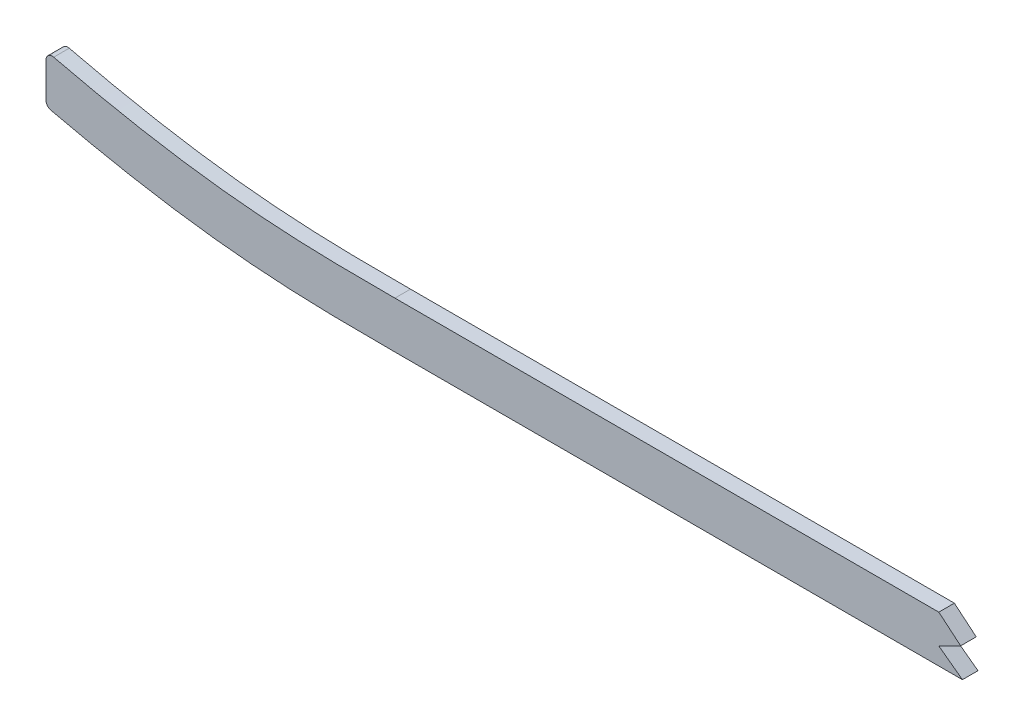
ISO-10303-21;
HEADER;
FILE_DESCRIPTION(('STEP AP214'),'2;1');
FILE_NAME('part.step','',(''),(''),'','','');
FILE_SCHEMA(('AUTOMOTIVE_DESIGN { 1 0 10303 214 1 1 1 1 }'));
ENDSEC;
DATA;
#1=APPLICATION_CONTEXT('core data for automotive mechanical design processes');
#2=APPLICATION_PROTOCOL_DEFINITION('international standard','automotive_design',2000,#1);
#3=PRODUCT_CONTEXT('',#1,'mechanical');
#4=PRODUCT('Part','Part','',(#3));
#5=PRODUCT_RELATED_PRODUCT_CATEGORY('part','',(#4));
#6=PRODUCT_DEFINITION_FORMATION('','',#4);
#7=PRODUCT_DEFINITION_CONTEXT('part definition',#1,'design');
#8=PRODUCT_DEFINITION('design','',#6,#7);
#9=PRODUCT_DEFINITION_SHAPE('','',#8);
#10=(LENGTH_UNIT() NAMED_UNIT(*) SI_UNIT(.MILLI.,.METRE.));
#11=(NAMED_UNIT(*) PLANE_ANGLE_UNIT() SI_UNIT($,.RADIAN.));
#12=(NAMED_UNIT(*) SI_UNIT($,.STERADIAN.) SOLID_ANGLE_UNIT());
#13=UNCERTAINTY_MEASURE_WITH_UNIT(LENGTH_MEASURE(1.E-05),#10,'distance_accuracy_value','');
#14=(GEOMETRIC_REPRESENTATION_CONTEXT(3) GLOBAL_UNCERTAINTY_ASSIGNED_CONTEXT((#13)) GLOBAL_UNIT_ASSIGNED_CONTEXT((#10,
#11,#12)) REPRESENTATION_CONTEXT('',''));
#15=CARTESIAN_POINT('',(0.,0.,0.));
#16=DIRECTION('',(0.,0.,1.));
#17=DIRECTION('',(1.,0.,0.));
#18=AXIS2_PLACEMENT_3D('',#15,#16,#17);
#19=CARTESIAN_POINT('',(499.61002795047,-34.4207027968771,3.175));
#20=CARTESIAN_POINT('',(488.614737518052,-34.4207027968771,3.175));
#21=CARTESIAN_POINT('',(472.2363953645,-34.4207027983821,3.175));
#22=CARTESIAN_POINT('',(449.940231846129,-34.420702794369,3.175));
#23=CARTESIAN_POINT('',(427.771305694794,-34.4207028104213,3.175));
#24=CARTESIAN_POINT('',(405.874681662796,-34.4207027121004,3.175));
#25=CARTESIAN_POINT('',(384.584909127846,-34.4207029418503,3.175));
#26=CARTESIAN_POINT('',(368.900229326161,-34.4207022443236,3.175));
#27=CARTESIAN_POINT('',(353.376568613047,-34.4207048621181,3.175));
#28=CARTESIAN_POINT('',(332.608466434546,-34.4206891858564,3.175));
#29=CARTESIAN_POINT('',(306.287754852687,-34.4205700055106,3.175));
#30=CARTESIAN_POINT('',(274.023487704489,-34.4205382555166,3.175));
#31=CARTESIAN_POINT('',(252.271015965112,-34.4207097406393,3.175));
#32=CARTESIAN_POINT('',(241.425150133728,-34.4207027610987,3.175));
#33=B_SPLINE_CURVE_WITH_KNOTS('',3,(#19,#20,#21,#22,#23,#24,#25,#26,#27,#28,#29,#30,#31,#32),
.UNSPECIFIED.,.F.,.F.,(4,1,1,1,1,1,1,1,1,1,1,4),(19.9068295096932,23.2201200173381,
24.8767652711605,26.5334105249829,29.8467010326278,31.5033462864503,33.1599915402727,
34.8166367940951,36.4732820479176,39.7865725555625,43.0998630632073,46.4131535708522),.UNSPECIFIED.);
#34=DIRECTION('',(0.,0.,-1.));
#35=VECTOR('',#34,1.);
#36=SURFACE_OF_LINEAR_EXTRUSION('',#33,#35);
#37=DIRECTION('',(0.,0.,1.));
#38=VECTOR('',#37,1.);
#39=CARTESIAN_POINT('',(463.358597157252,-34.4207027965464,-4.445));
#40=LINE('',#39,#38);
#41=CARTESIAN_POINT('',(463.358597157252,-34.4207027965464,-3.175));
#42=VERTEX_POINT('',#41);
#43=CARTESIAN_POINT('',(463.358597157252,-34.4207027965464,3.175));
#44=VERTEX_POINT('',#43);
#45=EDGE_CURVE('E225',#42,#44,#40,.T.);
#46=ORIENTED_EDGE('',*,*,#45,.F.);
#47=CARTESIAN_POINT('',(499.61002795047,-34.4207027968771,-3.175));
#48=CARTESIAN_POINT('',(488.614737518052,-34.4207027968771,-3.175));
#49=CARTESIAN_POINT('',(472.2363953645,-34.4207027983821,-3.175));
#50=CARTESIAN_POINT('',(449.940231846129,-34.420702794369,-3.175));
#51=CARTESIAN_POINT('',(427.771305694794,-34.4207028104213,-3.175));
#52=CARTESIAN_POINT('',(405.874681662796,-34.4207027121004,-3.175));
#53=CARTESIAN_POINT('',(384.584909127846,-34.4207029418503,-3.175));
#54=CARTESIAN_POINT('',(368.900229326161,-34.4207022443236,-3.175));
#55=CARTESIAN_POINT('',(353.376568613047,-34.4207048621181,-3.175));
#56=CARTESIAN_POINT('',(332.608466434546,-34.4206891858564,-3.175));
#57=CARTESIAN_POINT('',(306.287754852687,-34.4205700055106,-3.175));
#58=CARTESIAN_POINT('',(274.023487704489,-34.4205382555166,-3.175));
#59=CARTESIAN_POINT('',(252.271015965112,-34.4207097406393,-3.175));
#60=CARTESIAN_POINT('',(241.425150133728,-34.4207027610987,-3.175));
#61=B_SPLINE_CURVE_WITH_KNOTS('',3,(#47,#48,#49,#50,#51,#52,#53,#54,#55,#56,#57,#58,#59,#60),
.UNSPECIFIED.,.F.,.F.,(4,1,1,1,1,1,1,1,1,1,1,4),(19.9068295096932,23.2201200173381,
24.8767652711605,26.5334105249829,29.8467010326278,31.5033462864503,33.1599915402727,
34.8166367940951,36.4732820479176,39.7865725555625,43.0998630632073,46.4131535708522),.UNSPECIFIED.);
#62=CARTESIAN_POINT('',(241.425150133728,-34.4207027610987,-3.175));
#63=VERTEX_POINT('',#62);
#64=EDGE_CURVE('E132',#42,#63,#61,.T.);
#65=ORIENTED_EDGE('',*,*,#64,.T.);
#66=DIRECTION('',(0.,0.,-1.));
#67=VECTOR('',#66,1.);
#68=CARTESIAN_POINT('',(241.425150133728,-34.4207027610987,3.175));
#69=LINE('',#68,#67);
#70=CARTESIAN_POINT('',(241.425150133728,-34.4207027610987,3.175));
#71=VERTEX_POINT('',#70);
#72=EDGE_CURVE('E140',#71,#63,#69,.T.);
#73=ORIENTED_EDGE('',*,*,#72,.F.);
#74=EDGE_CURVE('E183',#44,#71,#33,.T.);
#75=ORIENTED_EDGE('',*,*,#74,.F.);
#76=EDGE_LOOP('',(#46,#65,#73,#75));
#77=FACE_BOUND('',#76,.T.);
#78=ADVANCED_FACE('F36',(#77),#36,.F.);
#79=CARTESIAN_POINT('',(241.425150133727,-34.4207027610987,3.175));
#80=CARTESIAN_POINT('',(239.394928853346,-34.4207014546091,3.175));
#81=CARTESIAN_POINT('',(235.322322927437,-34.4204958673979,3.175));
#82=CARTESIAN_POINT('',(227.274423442791,-34.3987025326526,3.175));
#83=CARTESIAN_POINT('',(217.319360062366,-34.2974668549065,3.175));
#84=CARTESIAN_POINT('',(205.53069007675,-33.9763855631146,3.175));
#85=CARTESIAN_POINT('',(189.963341914105,-33.212641270811,3.175));
#86=CARTESIAN_POINT('',(170.696984653264,-31.5434951938744,3.175));
#87=CARTESIAN_POINT('',(147.533261231625,-28.3143981281075,3.175));
#88=CARTESIAN_POINT('',(125.482753205671,-24.2021098716678,3.175));
#89=CARTESIAN_POINT('',(107.439912034299,-20.1965093867304,3.175));
#90=CARTESIAN_POINT('',(92.2061475243642,-16.4882107680275,3.175));
#91=CARTESIAN_POINT('',(75.9504648179075,-12.2555284402728,3.175));
#92=CARTESIAN_POINT('',(63.6202017572794,-8.75888456222131,3.175));
#93=CARTESIAN_POINT('',(56.1680099981378,-6.51526799609147,3.175));
#94=B_SPLINE_CURVE_WITH_KNOTS('',3,(#79,#80,#81,#82,#83,#84,#85,#86,#87,#88,#89,#90,#91,#92,
#93),.UNSPECIFIED.,.F.,.F.,(4,1,1,1,1,1,1,1,1,1,1,1,4),(0.,0.622088422177912,1.24417684435582,
2.48835368871165,3.73253053306747,4.9767073774233,7.46506106613495,9.9534147548466,
12.4417684435582,14.5582354197025,15.8024122640584,17.4184758209815,19.9068295096932),.UNSPECIFIED.);
#95=DIRECTION('',(0.,0.,-1.));
#96=VECTOR('',#95,1.);
#97=SURFACE_OF_LINEAR_EXTRUSION('',#94,#96);
#98=CARTESIAN_POINT('',(241.425150133727,-34.4207027610987,-3.175));
#99=CARTESIAN_POINT('',(239.394928853346,-34.4207014546091,-3.175));
#100=CARTESIAN_POINT('',(235.322322927437,-34.4204958673979,-3.175));
#101=CARTESIAN_POINT('',(227.274423442791,-34.3987025326526,-3.175));
#102=CARTESIAN_POINT('',(217.319360062366,-34.2974668549065,-3.175));
#103=CARTESIAN_POINT('',(205.53069007675,-33.9763855631146,-3.175));
#104=CARTESIAN_POINT('',(189.963341914105,-33.212641270811,-3.175));
#105=CARTESIAN_POINT('',(170.696984653264,-31.5434951938744,-3.175));
#106=CARTESIAN_POINT('',(147.533261231625,-28.3143981281075,-3.175));
#107=CARTESIAN_POINT('',(125.482753205671,-24.2021098716678,-3.175));
#108=CARTESIAN_POINT('',(107.439912034299,-20.1965093867304,-3.175));
#109=CARTESIAN_POINT('',(92.2061475243642,-16.4882107680275,-3.175));
#110=CARTESIAN_POINT('',(75.9504648179075,-12.2555284402728,-3.175));
#111=CARTESIAN_POINT('',(63.6202017572794,-8.75888456222131,-3.175));
#112=CARTESIAN_POINT('',(56.1680099981378,-6.51526799609147,-3.175));
#113=B_SPLINE_CURVE_WITH_KNOTS('',3,(#98,#99,#100,#101,#102,#103,#104,#105,#106,#107,#108,#109,
#110,#111,#112),.UNSPECIFIED.,.F.,.F.,(4,1,1,1,1,1,1,1,1,1,1,1,4),(0.,0.622088422177912,
1.24417684435582,2.48835368871165,3.73253053306747,4.9767073774233,7.46506106613495,
9.9534147548466,12.4417684435582,14.5582354197025,15.8024122640584,17.4184758209815,
19.9068295096932),.UNSPECIFIED.);
#114=CARTESIAN_POINT('',(102.190483981419,-18.9042359208893,-3.175));
#115=VERTEX_POINT('',#114);
#116=EDGE_CURVE('E252',#63,#115,#113,.T.);
#117=ORIENTED_EDGE('',*,*,#116,.T.);
#118=DIRECTION('',(0.,0.,-1.));
#119=VECTOR('',#118,1.);
#120=CARTESIAN_POINT('',(102.190483981419,-18.9042359208893,-3.175));
#121=LINE('',#120,#119);
#122=CARTESIAN_POINT('',(102.190483981419,-18.9042359208893,3.175));
#123=VERTEX_POINT('',#122);
#124=EDGE_CURVE('E216',#115,#123,#121,.F.);
#125=ORIENTED_EDGE('',*,*,#124,.T.);
#126=EDGE_CURVE('E178',#71,#123,#94,.T.);
#127=ORIENTED_EDGE('',*,*,#126,.F.);
#128=ORIENTED_EDGE('',*,*,#72,.T.);
#129=EDGE_LOOP('',(#117,#125,#127,#128));
#130=FACE_BOUND('',#129,.T.);
#131=ADVANCED_FACE('F171',(#130),#97,.F.);
#132=CARTESIAN_POINT('',(99.06,0.,3.175));
#133=DIRECTION('',(1.,0.,0.));
#134=DIRECTION('',(0.,1.,0.));
#135=AXIS2_PLACEMENT_3D('',#132,#133,#134);
#136=PLANE('',#135);
#137=DIRECTION('',(0.,-1.,0.));
#138=VECTOR('',#137,1.);
#139=CARTESIAN_POINT('',(99.06,0.,-3.175));
#140=LINE('',#139,#138);
#141=CARTESIAN_POINT('',(99.06,-21.3746465482321,-3.175));
#142=VERTEX_POINT('',#141);
#143=CARTESIAN_POINT('',(99.06,-35.7310663813545,-3.175));
#144=VERTEX_POINT('',#143);
#145=EDGE_CURVE('E242',#142,#144,#140,.T.);
#146=ORIENTED_EDGE('',*,*,#145,.T.);
#147=DIRECTION('',(0.,0.,1.));
#148=VECTOR('',#147,1.);
#149=CARTESIAN_POINT('',(99.06,-35.7310663813545,3.175));
#150=LINE('',#149,#148);
#151=CARTESIAN_POINT('',(99.06,-35.7310663813545,3.175));
#152=VERTEX_POINT('',#151);
#153=EDGE_CURVE('E202',#144,#152,#150,.T.);
#154=ORIENTED_EDGE('',*,*,#153,.T.);
#155=DIRECTION('',(0.,-1.,0.));
#156=VECTOR('',#155,1.);
#157=CARTESIAN_POINT('',(99.06,0.,3.175));
#158=LINE('',#157,#156);
#159=CARTESIAN_POINT('',(99.06,-21.3746465482321,3.175));
#160=VERTEX_POINT('',#159);
#161=EDGE_CURVE('E142',#160,#152,#158,.T.);
#162=ORIENTED_EDGE('',*,*,#161,.F.);
#163=DIRECTION('',(0.,0.,-1.));
#164=VECTOR('',#163,1.);
#165=CARTESIAN_POINT('',(99.06,-21.3746465482321,3.175));
#166=LINE('',#165,#164);
#167=EDGE_CURVE('E213',#160,#142,#166,.T.);
#168=ORIENTED_EDGE('',*,*,#167,.T.);
#169=EDGE_LOOP('',(#146,#154,#162,#168));
#170=FACE_BOUND('',#169,.T.);
#171=ADVANCED_FACE('F167',(#170),#136,.F.);
#172=CARTESIAN_POINT('',(241.425137874656,-53.4707027610947,3.175));
#173=CARTESIAN_POINT('',(224.286916993446,-53.4706917322934,3.175));
#174=CARTESIAN_POINT('',(207.149474966828,-53.46731537419,3.175));
#175=CARTESIAN_POINT('',(190.203897512927,-52.6865770783577,3.175));
#176=CARTESIAN_POINT('',(151.656098128873,-49.0318870359693,3.175));
#177=CARTESIAN_POINT('',(113.108298643588,-41.5036763395049,3.175));
#178=CARTESIAN_POINT('',(91.9499096911236,-36.3425549140717,3.175));
#179=CARTESIAN_POINT('',(71.3130359138117,-30.9695905800733,3.175));
#180=CARTESIAN_POINT('',(50.6761621364999,-24.7564879954398,3.175));
#181=(BOUNDED_CURVE() B_SPLINE_CURVE(5,(#172,#173,#174,#175,#176,#177,#178,#179,#180),
.UNSPECIFIED.,.F.,.F.) B_SPLINE_CURVE_WITH_KNOTS((6,3,6),(0.,8.71381607969319,19.9068295096932),
.UNSPECIFIED.) CURVE() GEOMETRIC_REPRESENTATION_ITEM() RATIONAL_B_SPLINE_CURVE((1.,1.,1.,1.,1.,
1.,1.,1.,1.)) REPRESENTATION_ITEM(''));
#182=DIRECTION('',(0.,0.,-1.));
#183=VECTOR('',#182,1.);
#184=SURFACE_OF_LINEAR_EXTRUSION('',#181,#183);
#185=CARTESIAN_POINT('',(241.425137874656,-53.4707027610947,3.175));
#186=VERTEX_POINT('',#185);
#187=CARTESIAN_POINT('',(101.019814361138,-38.2039158762608,3.175));
#188=VERTEX_POINT('',#187);
#189=EDGE_CURVE('E137',#186,#188,#181,.T.);
#190=ORIENTED_EDGE('',*,*,#189,.T.);
#191=DIRECTION('',(0.,0.,-1.));
#192=VECTOR('',#191,1.);
#193=CARTESIAN_POINT('',(101.019814361138,-38.2039158762608,3.175));
#194=LINE('',#193,#192);
#195=CARTESIAN_POINT('',(101.019814361138,-38.2039158762608,-3.175));
#196=VERTEX_POINT('',#195);
#197=EDGE_CURVE('E204',#188,#196,#194,.T.);
#198=ORIENTED_EDGE('',*,*,#197,.T.);
#199=CARTESIAN_POINT('',(241.425137874656,-53.4707027610947,-3.175));
#200=CARTESIAN_POINT('',(224.286916993446,-53.4706917322934,-3.175));
#201=CARTESIAN_POINT('',(207.149474966828,-53.46731537419,-3.175));
#202=CARTESIAN_POINT('',(190.203897512927,-52.6865770783577,-3.175));
#203=CARTESIAN_POINT('',(151.656098128873,-49.0318870359693,-3.175));
#204=CARTESIAN_POINT('',(113.108298643588,-41.5036763395049,-3.175));
#205=CARTESIAN_POINT('',(91.9499096911236,-36.3425549140717,-3.175));
#206=CARTESIAN_POINT('',(71.3130359138117,-30.9695905800733,-3.175));
#207=CARTESIAN_POINT('',(50.6761621364999,-24.7564879954398,-3.175));
#208=(BOUNDED_CURVE() B_SPLINE_CURVE(5,(#199,#200,#201,#202,#203,#204,#205,#206,#207),
.UNSPECIFIED.,.F.,.F.) B_SPLINE_CURVE_WITH_KNOTS((6,3,6),(0.,8.71381607969319,19.9068295096932),
.UNSPECIFIED.) CURVE() GEOMETRIC_REPRESENTATION_ITEM() RATIONAL_B_SPLINE_CURVE((1.,1.,1.,1.,1.,
1.,1.,1.,1.)) REPRESENTATION_ITEM(''));
#209=CARTESIAN_POINT('',(241.425137874656,-53.4707027610947,-3.175));
#210=VERTEX_POINT('',#209);
#211=EDGE_CURVE('E239',#210,#196,#208,.T.);
#212=ORIENTED_EDGE('',*,*,#211,.F.);
#213=DIRECTION('',(0.,0.,-1.));
#214=VECTOR('',#213,1.);
#215=CARTESIAN_POINT('',(241.425137874656,-53.4707027610947,3.175));
#216=LINE('',#215,#214);
#217=EDGE_CURVE('E138',#186,#210,#216,.T.);
#218=ORIENTED_EDGE('',*,*,#217,.F.);
#219=EDGE_LOOP('',(#190,#198,#212,#218));
#220=FACE_BOUND('',#219,.T.);
#221=ADVANCED_FACE('F162',(#220),#184,.T.);
#222=CARTESIAN_POINT('',(499.61002795047,-53.4707027968771,3.175));
#223=CARTESIAN_POINT('',(492.13682083511,-53.4707027968771,3.175));
#224=CARTESIAN_POINT('',(484.754348064359,-53.4707027968771,3.175));
#225=CARTESIAN_POINT('',(477.443025858661,-53.4707027968771,3.175));
#226=CARTESIAN_POINT('',(448.516583144859,-53.4707027968771,3.175));
#227=CARTESIAN_POINT('',(419.590140516906,-53.4707027968771,3.175));
#228=CARTESIAN_POINT('',(398.368118521171,-53.4707027968771,3.175));
#229=CARTESIAN_POINT('',(355.647540185946,-53.4707027968771,3.175));
#230=CARTESIAN_POINT('',(312.926961850721,-53.4707027968771,3.175));
#231=CARTESIAN_POINT('',(289.235090436449,-53.4702930294301,3.175));
#232=CARTESIAN_POINT('',(265.364963651298,-53.4707050337029,3.175));
#233=CARTESIAN_POINT('',(241.494836900486,-53.4707027893221,3.175));
#234=CARTESIAN_POINT('',(241.471603890762,-53.470702784812,3.175));
#235=CARTESIAN_POINT('',(241.448370881994,-53.4707027760456,3.175));
#236=CARTESIAN_POINT('',(241.425137874656,-53.4707027610947,3.175));
#237=(BOUNDED_CURVE() B_SPLINE_CURVE(5,(#222,#223,#224,#225,#226,#227,#228,#229,#230,#231,#232,
#233,#234,#235,#236),.UNSPECIFIED.,.F.,.F.) B_SPLINE_CURVE_WITH_KNOTS((6,3,3,3,6),
(19.9068295096932,23.6378973105454,34.2765455705454,46.4013409005454,46.4131535708522),
.UNSPECIFIED.) CURVE() GEOMETRIC_REPRESENTATION_ITEM() RATIONAL_B_SPLINE_CURVE((1.,1.,1.,1.,1.,
1.,1.,1.,1.,1.,1.,1.,1.,1.,1.)) REPRESENTATION_ITEM(''));
#238=DIRECTION('',(0.,0.,-1.));
#239=VECTOR('',#238,1.);
#240=SURFACE_OF_LINEAR_EXTRUSION('',#237,#239);
#241=DIRECTION('',(0.,0.,1.));
#242=VECTOR('',#241,1.);
#243=CARTESIAN_POINT('',(472.997412796544,-53.4707027968771,-4.445));
#244=LINE('',#243,#242);
#245=CARTESIAN_POINT('',(472.997412796544,-53.4707027968771,-3.175));
#246=VERTEX_POINT('',#245);
#247=CARTESIAN_POINT('',(472.997412796544,-53.4707027968771,3.175));
#248=VERTEX_POINT('',#247);
#249=EDGE_CURVE('E116',#246,#248,#244,.T.);
#250=ORIENTED_EDGE('',*,*,#249,.T.);
#251=EDGE_CURVE('E129',#248,#186,#237,.T.);
#252=ORIENTED_EDGE('',*,*,#251,.T.);
#253=ORIENTED_EDGE('',*,*,#217,.T.);
#254=CARTESIAN_POINT('',(499.61002795047,-53.4707027968771,-3.175));
#255=CARTESIAN_POINT('',(492.13682083511,-53.4707027968771,-3.175));
#256=CARTESIAN_POINT('',(484.754348064359,-53.4707027968771,-3.175));
#257=CARTESIAN_POINT('',(477.443025858661,-53.4707027968771,-3.175));
#258=CARTESIAN_POINT('',(448.516583144859,-53.4707027968771,-3.175));
#259=CARTESIAN_POINT('',(419.590140516906,-53.4707027968771,-3.175));
#260=CARTESIAN_POINT('',(398.368118521171,-53.4707027968771,-3.175));
#261=CARTESIAN_POINT('',(355.647540185946,-53.4707027968771,-3.175));
#262=CARTESIAN_POINT('',(312.926961850721,-53.4707027968771,-3.175));
#263=CARTESIAN_POINT('',(289.235090436449,-53.4702930294301,-3.175));
#264=CARTESIAN_POINT('',(265.364963651298,-53.4707050337029,-3.175));
#265=CARTESIAN_POINT('',(241.494836900486,-53.4707027893221,-3.175));
#266=CARTESIAN_POINT('',(241.471603890762,-53.470702784812,-3.175));
#267=CARTESIAN_POINT('',(241.448370881994,-53.4707027760456,-3.175));
#268=CARTESIAN_POINT('',(241.425137874656,-53.4707027610947,-3.175));
#269=(BOUNDED_CURVE() B_SPLINE_CURVE(5,(#254,#255,#256,#257,#258,#259,#260,#261,#262,#263,#264,
#265,#266,#267,#268),.UNSPECIFIED.,.F.,.F.) B_SPLINE_CURVE_WITH_KNOTS((6,3,3,3,6),
(19.9068295096932,23.6378973105454,34.2765455705454,46.4013409005454,46.4131535708522),
.UNSPECIFIED.) CURVE() GEOMETRIC_REPRESENTATION_ITEM() RATIONAL_B_SPLINE_CURVE((1.,1.,1.,1.,1.,
1.,1.,1.,1.,1.,1.,1.,1.,1.,1.)) REPRESENTATION_ITEM(''));
#270=EDGE_CURVE('E131',#246,#210,#269,.T.);
#271=ORIENTED_EDGE('',*,*,#270,.F.);
#272=EDGE_LOOP('',(#250,#252,#253,#271));
#273=FACE_BOUND('',#272,.T.);
#274=ADVANCED_FACE('F127',(#273),#240,.T.);
#275=CARTESIAN_POINT('',(0.,0.,3.175));
#276=DIRECTION('',(0.,0.,1.));
#277=DIRECTION('',(1.,0.,0.));
#278=AXIS2_PLACEMENT_3D('',#275,#276,#277);
#279=PLANE('',#278);
#280=DIRECTION('',(0.805685409443556,-0.592343667991622,0.));
#281=VECTOR('',#280,1.);
#282=CARTESIAN_POINT('',(463.358597157252,-46.3842006163091,3.175));
#283=LINE('',#282,#281);
#284=CARTESIAN_POINT('',(463.358597157252,-46.3842006163091,3.175));
#285=VERTEX_POINT('',#284);
#286=EDGE_CURVE('E113',#285,#248,#283,.T.);
#287=ORIENTED_EDGE('',*,*,#286,.F.);
#288=DIRECTION('',(-0.892284614904802,-0.451473328120488,0.));
#289=VECTOR('',#288,1.);
#290=CARTESIAN_POINT('',(472.27165658482,-41.8744191673383,3.175));
#291=LINE('',#290,#289);
#292=CARTESIAN_POINT('',(472.27165658482,-41.8744191673383,3.175));
#293=VERTEX_POINT('',#292);
#294=EDGE_CURVE('E123',#293,#285,#291,.T.);
#295=ORIENTED_EDGE('',*,*,#294,.F.);
#296=DIRECTION('',(0.767112549842051,-0.641512537581945,0.));
#297=VECTOR('',#296,1.);
#298=CARTESIAN_POINT('',(463.358597157252,-34.4207027965464,3.175));
#299=LINE('',#298,#297);
#300=EDGE_CURVE('E229',#44,#293,#299,.T.);
#301=ORIENTED_EDGE('',*,*,#300,.F.);
#302=ORIENTED_EDGE('',*,*,#74,.T.);
#303=ORIENTED_EDGE('',*,*,#126,.T.);
#304=CARTESIAN_POINT('',(101.6,-21.3746465482321,3.175));
#305=DIRECTION('',(0.,0.,1.));
#306=DIRECTION('',(1.,0.,0.));
#307=AXIS2_PLACEMENT_3D('',#304,#305,#306);
#308=CIRCLE('',#307,2.54);
#309=EDGE_CURVE('E195',#123,#160,#308,.T.);
#310=ORIENTED_EDGE('',*,*,#309,.T.);
#311=ORIENTED_EDGE('',*,*,#161,.T.);
#312=CARTESIAN_POINT('',(101.6,-35.7310663813545,3.175));
#313=DIRECTION('',(0.,0.,1.));
#314=DIRECTION('',(1.,0.,0.));
#315=AXIS2_PLACEMENT_3D('',#312,#313,#314);
#316=CIRCLE('',#315,2.54);
#317=EDGE_CURVE('E193',#152,#188,#316,.T.);
#318=ORIENTED_EDGE('',*,*,#317,.T.);
#319=ORIENTED_EDGE('',*,*,#189,.F.);
#320=ORIENTED_EDGE('',*,*,#251,.F.);
#321=EDGE_LOOP('',(#287,#295,#301,#302,#303,#310,#311,#318,#319,#320));
#322=FACE_BOUND('',#321,.T.);
#323=ADVANCED_FACE('F135',(#322),#279,.T.);
#324=CARTESIAN_POINT('',(0.,0.,-3.175));
#325=DIRECTION('',(0.,0.,1.));
#326=DIRECTION('',(1.,0.,0.));
#327=AXIS2_PLACEMENT_3D('',#324,#325,#326);
#328=PLANE('',#327);
#329=DIRECTION('',(-0.892284614904802,-0.451473328120488,0.));
#330=VECTOR('',#329,1.);
#331=CARTESIAN_POINT('',(113.131069893468,-223.590424608033,-3.175));
#332=LINE('',#331,#330);
#333=CARTESIAN_POINT('',(472.27165658482,-41.8744191673383,-3.175));
#334=VERTEX_POINT('',#333);
#335=CARTESIAN_POINT('',(463.358597157252,-46.3842006163091,-3.175));
#336=VERTEX_POINT('',#335);
#337=EDGE_CURVE('E44',#334,#336,#332,.T.);
#338=ORIENTED_EDGE('',*,*,#337,.T.);
#339=DIRECTION('',(0.805685409443556,-0.592343667991622,0.));
#340=VECTOR('',#339,1.);
#341=CARTESIAN_POINT('',(140.442585226552,191.02515633402,-3.175));
#342=LINE('',#341,#340);
#343=EDGE_CURVE('E11',#336,#246,#342,.T.);
#344=ORIENTED_EDGE('',*,*,#343,.T.);
#345=ORIENTED_EDGE('',*,*,#270,.T.);
#346=ORIENTED_EDGE('',*,*,#211,.T.);
#347=CARTESIAN_POINT('',(101.6,-35.7310663813545,-3.175));
#348=DIRECTION('',(0.,0.,1.));
#349=DIRECTION('',(1.,0.,0.));
#350=AXIS2_PLACEMENT_3D('',#347,#348,#349);
#351=CIRCLE('',#350,2.54);
#352=EDGE_CURVE('E206',#196,#144,#351,.F.);
#353=ORIENTED_EDGE('',*,*,#352,.T.);
#354=ORIENTED_EDGE('',*,*,#145,.F.);
#355=CARTESIAN_POINT('',(101.6,-21.3746465482321,-3.175));
#356=DIRECTION('',(0.,0.,1.));
#357=DIRECTION('',(1.,0.,0.));
#358=AXIS2_PLACEMENT_3D('',#355,#356,#357);
#359=CIRCLE('',#358,2.54);
#360=EDGE_CURVE('E59',#142,#115,#359,.F.);
#361=ORIENTED_EDGE('',*,*,#360,.T.);
#362=ORIENTED_EDGE('',*,*,#116,.F.);
#363=ORIENTED_EDGE('',*,*,#64,.F.);
#364=DIRECTION('',(0.767112549842051,-0.641512537581945,0.));
#365=VECTOR('',#364,1.);
#366=CARTESIAN_POINT('',(173.750974131154,207.769209477475,-3.175));
#367=LINE('',#366,#365);
#368=EDGE_CURVE('E218',#42,#334,#367,.T.);
#369=ORIENTED_EDGE('',*,*,#368,.T.);
#370=EDGE_LOOP('',(#338,#344,#345,#346,#353,#354,#361,#362,#363,#369));
#371=FACE_BOUND('',#370,.T.);
#372=ADVANCED_FACE('F163',(#371),#328,.F.);
#373=CARTESIAN_POINT('',(101.6,-35.7310663813545,0.));
#374=DIRECTION('',(0.,0.,-1.));
#375=DIRECTION('',(-1.,0.,0.));
#376=AXIS2_PLACEMENT_3D('',#373,#374,#375);
#377=CYLINDRICAL_SURFACE('',#376,2.54);
#378=ORIENTED_EDGE('',*,*,#317,.F.);
#379=ORIENTED_EDGE('',*,*,#153,.F.);
#380=ORIENTED_EDGE('',*,*,#352,.F.);
#381=ORIENTED_EDGE('',*,*,#197,.F.);
#382=EDGE_LOOP('',(#378,#379,#380,#381));
#383=FACE_BOUND('',#382,.T.);
#384=ADVANCED_FACE('F201',(#383),#377,.T.);
#385=CARTESIAN_POINT('',(101.6,-21.3746465482321,0.));
#386=DIRECTION('',(0.,0.,-1.));
#387=DIRECTION('',(-1.,0.,0.));
#388=AXIS2_PLACEMENT_3D('',#385,#386,#387);
#389=CYLINDRICAL_SURFACE('',#388,2.54);
#390=ORIENTED_EDGE('',*,*,#309,.F.);
#391=ORIENTED_EDGE('',*,*,#124,.F.);
#392=ORIENTED_EDGE('',*,*,#360,.F.);
#393=ORIENTED_EDGE('',*,*,#167,.F.);
#394=EDGE_LOOP('',(#390,#391,#392,#393));
#395=FACE_BOUND('',#394,.T.);
#396=ADVANCED_FACE('F38',(#395),#389,.T.);
#397=CARTESIAN_POINT('',(463.358597157252,-46.3842006163091,-4.445));
#398=DIRECTION('',(-0.592343667991622,-0.805685409443556,0.));
#399=DIRECTION('',(0.805685409443556,-0.592343667991622,0.));
#400=AXIS2_PLACEMENT_3D('',#397,#398,#399);
#401=PLANE('',#400);
#402=DIRECTION('',(0.,0.,1.));
#403=VECTOR('',#402,1.);
#404=CARTESIAN_POINT('',(463.358597157252,-46.3842006163091,-4.445));
#405=LINE('',#404,#403);
#406=EDGE_CURVE('E118',#336,#285,#405,.T.);
#407=ORIENTED_EDGE('',*,*,#406,.T.);
#408=ORIENTED_EDGE('',*,*,#286,.T.);
#409=ORIENTED_EDGE('',*,*,#249,.F.);
#410=ORIENTED_EDGE('',*,*,#343,.F.);
#411=EDGE_LOOP('',(#407,#408,#409,#410));
#412=FACE_BOUND('',#411,.T.);
#413=ADVANCED_FACE('F115',(#412),#401,.F.);
#414=CARTESIAN_POINT('',(472.27165658482,-41.8744191673383,-4.445));
#415=DIRECTION('',(-0.451473328120488,0.892284614904802,0.));
#416=DIRECTION('',(-0.892284614904802,-0.451473328120488,0.));
#417=AXIS2_PLACEMENT_3D('',#414,#415,#416);
#418=PLANE('',#417);
#419=DIRECTION('',(0.,0.,1.));
#420=VECTOR('',#419,1.);
#421=CARTESIAN_POINT('',(472.27165658482,-41.8744191673383,-4.445));
#422=LINE('',#421,#420);
#423=EDGE_CURVE('E51',#334,#293,#422,.T.);
#424=ORIENTED_EDGE('',*,*,#423,.T.);
#425=ORIENTED_EDGE('',*,*,#294,.T.);
#426=ORIENTED_EDGE('',*,*,#406,.F.);
#427=ORIENTED_EDGE('',*,*,#337,.F.);
#428=EDGE_LOOP('',(#424,#425,#426,#427));
#429=FACE_BOUND('',#428,.T.);
#430=ADVANCED_FACE('F223',(#429),#418,.F.);
#431=CARTESIAN_POINT('',(463.358597157252,-34.4207027965464,-4.445));
#432=DIRECTION('',(-0.641512537581945,-0.767112549842051,0.));
#433=DIRECTION('',(0.767112549842051,-0.641512537581945,0.));
#434=AXIS2_PLACEMENT_3D('',#431,#432,#433);
#435=PLANE('',#434);
#436=ORIENTED_EDGE('',*,*,#45,.T.);
#437=ORIENTED_EDGE('',*,*,#300,.T.);
#438=ORIENTED_EDGE('',*,*,#423,.F.);
#439=ORIENTED_EDGE('',*,*,#368,.F.);
#440=EDGE_LOOP('',(#436,#437,#438,#439));
#441=FACE_BOUND('',#440,.T.);
#442=ADVANCED_FACE('F232',(#441),#435,.F.);
#443=CLOSED_SHELL('',(#78,#131,#171,#221,#274,#323,#372,#384,#396,#413,#430,#442));
#444=MANIFOLD_SOLID_BREP('B2',#443);
#445=ADVANCED_BREP_SHAPE_REPRESENTATION('',(#18,#444),#14);
#446=SHAPE_DEFINITION_REPRESENTATION(#9,#445);
ENDSEC;
END-ISO-10303-21;
